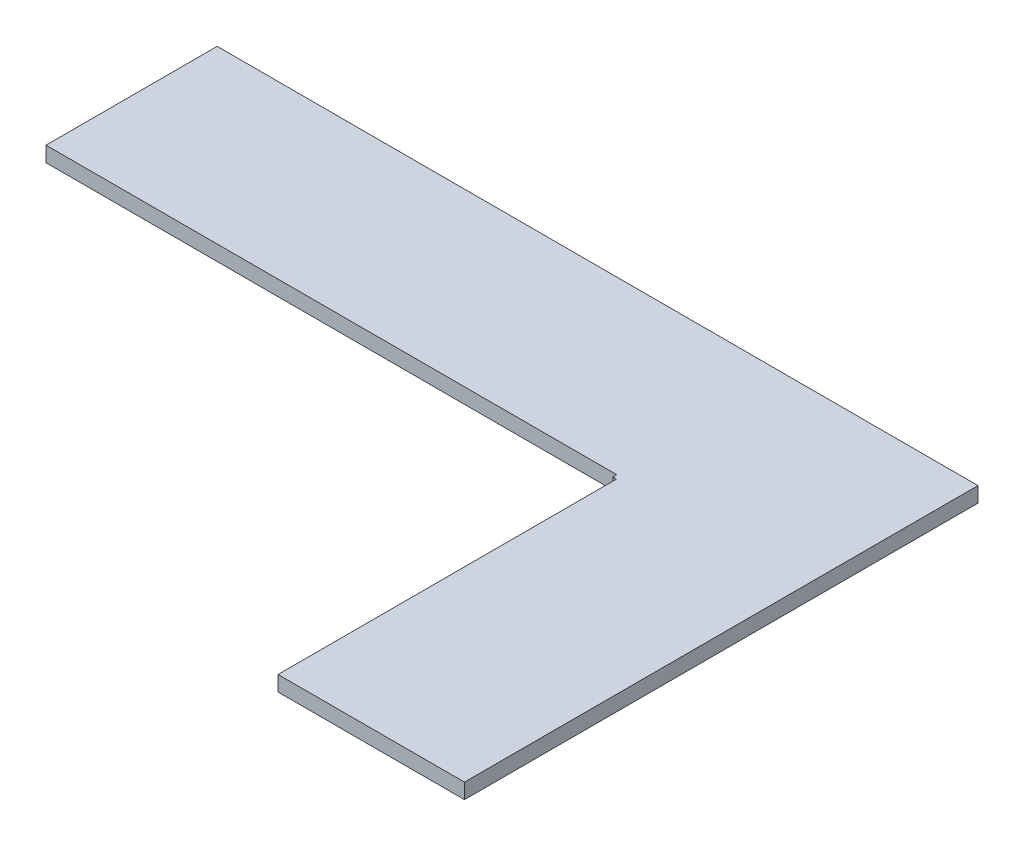
ISO-10303-21;
HEADER;
FILE_DESCRIPTION(('STEP AP214'),'2;1');
FILE_NAME('part.step','',(''),(''),'','','');
FILE_SCHEMA(('AUTOMOTIVE_DESIGN { 1 0 10303 214 1 1 1 1 }'));
ENDSEC;
DATA;
#1=APPLICATION_CONTEXT('core data for automotive mechanical design processes');
#2=APPLICATION_PROTOCOL_DEFINITION('international standard','automotive_design',2000,#1);
#3=PRODUCT_CONTEXT('',#1,'mechanical');
#4=PRODUCT('Part','Part','',(#3));
#5=PRODUCT_RELATED_PRODUCT_CATEGORY('part','',(#4));
#6=PRODUCT_DEFINITION_FORMATION('','',#4);
#7=PRODUCT_DEFINITION_CONTEXT('part definition',#1,'design');
#8=PRODUCT_DEFINITION('design','',#6,#7);
#9=PRODUCT_DEFINITION_SHAPE('','',#8);
#10=(LENGTH_UNIT() NAMED_UNIT(*) SI_UNIT(.MILLI.,.METRE.));
#11=(NAMED_UNIT(*) PLANE_ANGLE_UNIT() SI_UNIT($,.RADIAN.));
#12=(NAMED_UNIT(*) SI_UNIT($,.STERADIAN.) SOLID_ANGLE_UNIT());
#13=UNCERTAINTY_MEASURE_WITH_UNIT(LENGTH_MEASURE(1.E-05),#10,'distance_accuracy_value','');
#14=(GEOMETRIC_REPRESENTATION_CONTEXT(3) GLOBAL_UNCERTAINTY_ASSIGNED_CONTEXT((#13)) GLOBAL_UNIT_ASSIGNED_CONTEXT((#10,
#11,#12)) REPRESENTATION_CONTEXT('',''));
#15=CARTESIAN_POINT('',(0.,0.,0.));
#16=DIRECTION('',(0.,0.,1.));
#17=DIRECTION('',(1.,0.,0.));
#18=AXIS2_PLACEMENT_3D('',#15,#16,#17);
#19=CARTESIAN_POINT('',(0.,4.,-585.));
#20=DIRECTION('',(0.,0.,1.));
#21=DIRECTION('',(1.,0.,0.));
#22=AXIS2_PLACEMENT_3D('',#19,#20,#21);
#23=PLANE('',#22);
#24=DIRECTION('',(0.,1.,0.));
#25=VECTOR('',#24,1.);
#26=CARTESIAN_POINT('',(201.,8.,-585.));
#27=LINE('',#26,#25);
#28=CARTESIAN_POINT('',(201.,4.,-585.));
#29=VERTEX_POINT('',#28);
#30=CARTESIAN_POINT('',(201.,8.,-585.));
#31=VERTEX_POINT('',#30);
#32=EDGE_CURVE('E116',#29,#31,#27,.T.);
#33=ORIENTED_EDGE('',*,*,#32,.F.);
#34=DIRECTION('',(1.,0.,0.));
#35=VECTOR('',#34,1.);
#36=CARTESIAN_POINT('',(0.,4.,-585.));
#37=LINE('',#36,#35);
#38=CARTESIAN_POINT('',(250.,4.,-585.));
#39=VERTEX_POINT('',#38);
#40=EDGE_CURVE('E163',#29,#39,#37,.T.);
#41=ORIENTED_EDGE('',*,*,#40,.T.);
#42=DIRECTION('',(0.,1.,0.));
#43=VECTOR('',#42,1.);
#44=CARTESIAN_POINT('',(250.,4.,-585.));
#45=LINE('',#44,#43);
#46=CARTESIAN_POINT('',(250.,8.,-585.));
#47=VERTEX_POINT('',#46);
#48=EDGE_CURVE('E11',#39,#47,#45,.T.);
#49=ORIENTED_EDGE('',*,*,#48,.T.);
#50=DIRECTION('',(1.,0.,0.));
#51=VECTOR('',#50,1.);
#52=CARTESIAN_POINT('',(0.,8.,-585.));
#53=LINE('',#52,#51);
#54=EDGE_CURVE('E128',#31,#47,#53,.T.);
#55=ORIENTED_EDGE('',*,*,#54,.F.);
#56=EDGE_LOOP('',(#33,#41,#49,#55));
#57=FACE_BOUND('',#56,.T.);
#58=ADVANCED_FACE('F38',(#57),#23,.T.);
#59=CARTESIAN_POINT('',(250.,4.,0.));
#60=DIRECTION('',(-1.,0.,0.));
#61=DIRECTION('',(0.,0.,1.));
#62=AXIS2_PLACEMENT_3D('',#59,#60,#61);
#63=PLANE('',#62);
#64=ORIENTED_EDGE('',*,*,#48,.F.);
#65=DIRECTION('',(0.,0.,1.));
#66=VECTOR('',#65,1.);
#67=CARTESIAN_POINT('',(250.,4.,0.));
#68=LINE('',#67,#66);
#69=CARTESIAN_POINT('',(250.,4.,-720.));
#70=VERTEX_POINT('',#69);
#71=EDGE_CURVE('E159',#39,#70,#68,.F.);
#72=ORIENTED_EDGE('',*,*,#71,.T.);
#73=DIRECTION('',(0.,1.,0.));
#74=VECTOR('',#73,1.);
#75=CARTESIAN_POINT('',(250.,4.,-720.));
#76=LINE('',#75,#74);
#77=CARTESIAN_POINT('',(250.,8.,-720.));
#78=VERTEX_POINT('',#77);
#79=EDGE_CURVE('E48',#70,#78,#76,.T.);
#80=ORIENTED_EDGE('',*,*,#79,.T.);
#81=DIRECTION('',(0.,0.,1.));
#82=VECTOR('',#81,1.);
#83=CARTESIAN_POINT('',(250.,8.,0.));
#84=LINE('',#83,#82);
#85=EDGE_CURVE('E135',#47,#78,#84,.F.);
#86=ORIENTED_EDGE('',*,*,#85,.F.);
#87=EDGE_LOOP('',(#64,#72,#80,#86));
#88=FACE_BOUND('',#87,.T.);
#89=ADVANCED_FACE('F175',(#88),#63,.F.);
#90=CARTESIAN_POINT('',(0.,4.,-720.));
#91=DIRECTION('',(0.,0.,1.));
#92=DIRECTION('',(1.,0.,0.));
#93=AXIS2_PLACEMENT_3D('',#90,#91,#92);
#94=PLANE('',#93);
#95=ORIENTED_EDGE('',*,*,#79,.F.);
#96=DIRECTION('',(1.,0.,0.));
#97=VECTOR('',#96,1.);
#98=CARTESIAN_POINT('',(0.,4.,-720.));
#99=LINE('',#98,#97);
#100=CARTESIAN_POINT('',(50.0000000000001,4.,-720.));
#101=VERTEX_POINT('',#100);
#102=EDGE_CURVE('E155',#70,#101,#99,.F.);
#103=ORIENTED_EDGE('',*,*,#102,.T.);
#104=DIRECTION('',(0.,1.,0.));
#105=VECTOR('',#104,1.);
#106=CARTESIAN_POINT('',(50.0000000000001,4.,-720.));
#107=LINE('',#106,#105);
#108=CARTESIAN_POINT('',(50.0000000000001,8.,-720.));
#109=VERTEX_POINT('',#108);
#110=EDGE_CURVE('E170',#101,#109,#107,.T.);
#111=ORIENTED_EDGE('',*,*,#110,.T.);
#112=DIRECTION('',(1.,0.,0.));
#113=VECTOR('',#112,1.);
#114=CARTESIAN_POINT('',(0.,8.,-720.));
#115=LINE('',#114,#113);
#116=EDGE_CURVE('E140',#78,#109,#115,.F.);
#117=ORIENTED_EDGE('',*,*,#116,.F.);
#118=EDGE_LOOP('',(#95,#103,#111,#117));
#119=FACE_BOUND('',#118,.T.);
#120=ADVANCED_FACE('F182',(#119),#94,.F.);
#121=CARTESIAN_POINT('',(50.0000000000001,4.,0.));
#122=DIRECTION('',(-1.,0.,0.));
#123=DIRECTION('',(0.,0.,1.));
#124=AXIS2_PLACEMENT_3D('',#121,#122,#123);
#125=PLANE('',#124);
#126=ORIENTED_EDGE('',*,*,#110,.F.);
#127=DIRECTION('',(0.,0.,1.));
#128=VECTOR('',#127,1.);
#129=CARTESIAN_POINT('',(50.0000000000001,4.,0.));
#130=LINE('',#129,#128);
#131=CARTESIAN_POINT('',(50.0000000000001,4.,-675.));
#132=VERTEX_POINT('',#131);
#133=EDGE_CURVE('E152',#101,#132,#130,.T.);
#134=ORIENTED_EDGE('',*,*,#133,.T.);
#135=DIRECTION('',(0.,1.,0.));
#136=VECTOR('',#135,1.);
#137=CARTESIAN_POINT('',(50.0000000000001,4.,-675.));
#138=LINE('',#137,#136);
#139=CARTESIAN_POINT('',(50.0000000000001,8.,-675.));
#140=VERTEX_POINT('',#139);
#141=EDGE_CURVE('E64',#132,#140,#138,.T.);
#142=ORIENTED_EDGE('',*,*,#141,.T.);
#143=DIRECTION('',(0.,0.,1.));
#144=VECTOR('',#143,1.);
#145=CARTESIAN_POINT('',(50.0000000000001,8.,0.));
#146=LINE('',#145,#144);
#147=EDGE_CURVE('E184',#109,#140,#146,.T.);
#148=ORIENTED_EDGE('',*,*,#147,.F.);
#149=EDGE_LOOP('',(#126,#134,#142,#148));
#150=FACE_BOUND('',#149,.T.);
#151=ADVANCED_FACE('F207',(#150),#125,.T.);
#152=CARTESIAN_POINT('',(0.,4.,-675.));
#153=DIRECTION('',(0.,0.,1.));
#154=DIRECTION('',(1.,0.,0.));
#155=AXIS2_PLACEMENT_3D('',#152,#153,#154);
#156=PLANE('',#155);
#157=ORIENTED_EDGE('',*,*,#141,.F.);
#158=DIRECTION('',(1.,0.,0.));
#159=VECTOR('',#158,1.);
#160=CARTESIAN_POINT('',(0.,4.,-675.));
#161=LINE('',#160,#159);
#162=CARTESIAN_POINT('',(200.,4.,-675.));
#163=VERTEX_POINT('',#162);
#164=EDGE_CURVE('E146',#132,#163,#161,.T.);
#165=ORIENTED_EDGE('',*,*,#164,.T.);
#166=DIRECTION('',(0.,1.,0.));
#167=VECTOR('',#166,1.);
#168=CARTESIAN_POINT('',(200.,4.,-675.));
#169=LINE('',#168,#167);
#170=CARTESIAN_POINT('',(200.,8.,-675.));
#171=VERTEX_POINT('',#170);
#172=EDGE_CURVE('E42',#163,#171,#169,.T.);
#173=ORIENTED_EDGE('',*,*,#172,.T.);
#174=DIRECTION('',(1.,0.,0.));
#175=VECTOR('',#174,1.);
#176=CARTESIAN_POINT('',(0.,8.,-675.));
#177=LINE('',#176,#175);
#178=EDGE_CURVE('E142',#140,#171,#177,.T.);
#179=ORIENTED_EDGE('',*,*,#178,.F.);
#180=EDGE_LOOP('',(#157,#165,#173,#179));
#181=FACE_BOUND('',#180,.T.);
#182=ADVANCED_FACE('F204',(#181),#156,.T.);
#183=CARTESIAN_POINT('',(200.,4.,0.));
#184=DIRECTION('',(-1.,0.,0.));
#185=DIRECTION('',(0.,0.,1.));
#186=AXIS2_PLACEMENT_3D('',#183,#184,#185);
#187=PLANE('',#186);
#188=DIRECTION('',(0.,-1.,0.));
#189=VECTOR('',#188,1.);
#190=CARTESIAN_POINT('',(200.,7.99999999999999,-674.));
#191=LINE('',#190,#189);
#192=CARTESIAN_POINT('',(200.,7.99999999999999,-674.));
#193=VERTEX_POINT('',#192);
#194=CARTESIAN_POINT('',(200.,4.,-674.));
#195=VERTEX_POINT('',#194);
#196=EDGE_CURVE('E114',#193,#195,#191,.T.);
#197=ORIENTED_EDGE('',*,*,#196,.F.);
#198=DIRECTION('',(0.,0.,1.));
#199=VECTOR('',#198,1.);
#200=CARTESIAN_POINT('',(200.,8.,0.));
#201=LINE('',#200,#199);
#202=EDGE_CURVE('E136',#171,#193,#201,.T.);
#203=ORIENTED_EDGE('',*,*,#202,.F.);
#204=ORIENTED_EDGE('',*,*,#172,.F.);
#205=DIRECTION('',(0.,0.,1.));
#206=VECTOR('',#205,1.);
#207=CARTESIAN_POINT('',(200.,4.,0.));
#208=LINE('',#207,#206);
#209=EDGE_CURVE('E150',#163,#195,#208,.T.);
#210=ORIENTED_EDGE('',*,*,#209,.T.);
#211=EDGE_LOOP('',(#197,#203,#204,#210));
#212=FACE_BOUND('',#211,.T.);
#213=ADVANCED_FACE('F40',(#212),#187,.T.);
#214=CARTESIAN_POINT('',(0.,8.,0.));
#215=DIRECTION('',(0.,1.,0.));
#216=DIRECTION('',(0.,0.,1.));
#217=AXIS2_PLACEMENT_3D('',#214,#215,#216);
#218=PLANE('',#217);
#219=DIRECTION('',(-1.,0.,0.));
#220=VECTOR('',#219,1.);
#221=CARTESIAN_POINT('',(201.,7.99999999999999,-674.));
#222=LINE('',#221,#220);
#223=CARTESIAN_POINT('',(201.,7.99999999999999,-674.));
#224=VERTEX_POINT('',#223);
#225=EDGE_CURVE('E112',#224,#193,#222,.T.);
#226=ORIENTED_EDGE('',*,*,#225,.F.);
#227=DIRECTION('',(0.,0.,-1.));
#228=VECTOR('',#227,1.);
#229=CARTESIAN_POINT('',(201.,8.,-585.));
#230=LINE('',#229,#228);
#231=EDGE_CURVE('E119',#31,#224,#230,.T.);
#232=ORIENTED_EDGE('',*,*,#231,.F.);
#233=ORIENTED_EDGE('',*,*,#54,.T.);
#234=ORIENTED_EDGE('',*,*,#85,.T.);
#235=ORIENTED_EDGE('',*,*,#116,.T.);
#236=ORIENTED_EDGE('',*,*,#147,.T.);
#237=ORIENTED_EDGE('',*,*,#178,.T.);
#238=ORIENTED_EDGE('',*,*,#202,.T.);
#239=EDGE_LOOP('',(#226,#232,#233,#234,#235,#236,#237,#238));
#240=FACE_BOUND('',#239,.T.);
#241=ADVANCED_FACE('F126',(#240),#218,.T.);
#242=CARTESIAN_POINT('',(0.,4.,0.));
#243=DIRECTION('',(0.,1.,0.));
#244=DIRECTION('',(0.,0.,1.));
#245=AXIS2_PLACEMENT_3D('',#242,#243,#244);
#246=PLANE('',#245);
#247=DIRECTION('',(0.,0.,1.));
#248=VECTOR('',#247,1.);
#249=CARTESIAN_POINT('',(201.,4.,-585.));
#250=LINE('',#249,#248);
#251=CARTESIAN_POINT('',(201.,4.,-674.));
#252=VERTEX_POINT('',#251);
#253=EDGE_CURVE('E102',#252,#29,#250,.T.);
#254=ORIENTED_EDGE('',*,*,#253,.F.);
#255=DIRECTION('',(-1.,0.,0.));
#256=VECTOR('',#255,1.);
#257=CARTESIAN_POINT('',(201.,4.,-674.));
#258=LINE('',#257,#256);
#259=EDGE_CURVE('E151',#252,#195,#258,.T.);
#260=ORIENTED_EDGE('',*,*,#259,.T.);
#261=ORIENTED_EDGE('',*,*,#209,.F.);
#262=ORIENTED_EDGE('',*,*,#164,.F.);
#263=ORIENTED_EDGE('',*,*,#133,.F.);
#264=ORIENTED_EDGE('',*,*,#102,.F.);
#265=ORIENTED_EDGE('',*,*,#71,.F.);
#266=ORIENTED_EDGE('',*,*,#40,.F.);
#267=EDGE_LOOP('',(#254,#260,#261,#262,#263,#264,#265,#266));
#268=FACE_BOUND('',#267,.T.);
#269=ADVANCED_FACE('F201',(#268),#246,.F.);
#270=CARTESIAN_POINT('',(201.,7.99999999999999,-674.));
#271=DIRECTION('',(0.,0.,-1.));
#272=DIRECTION('',(-1.,0.,0.));
#273=AXIS2_PLACEMENT_3D('',#270,#271,#272);
#274=PLANE('',#273);
#275=ORIENTED_EDGE('',*,*,#196,.T.);
#276=ORIENTED_EDGE('',*,*,#259,.F.);
#277=DIRECTION('',(0.,-1.,0.));
#278=VECTOR('',#277,1.);
#279=CARTESIAN_POINT('',(201.,7.99999999999999,-674.));
#280=LINE('',#279,#278);
#281=EDGE_CURVE('E55',#224,#252,#280,.T.);
#282=ORIENTED_EDGE('',*,*,#281,.F.);
#283=ORIENTED_EDGE('',*,*,#225,.T.);
#284=EDGE_LOOP('',(#275,#276,#282,#283));
#285=FACE_BOUND('',#284,.T.);
#286=ADVANCED_FACE('F263',(#285),#274,.F.);
#287=CARTESIAN_POINT('',(201.,0.,0.));
#288=DIRECTION('',(1.,0.,0.));
#289=DIRECTION('',(0.,0.,-1.));
#290=AXIS2_PLACEMENT_3D('',#287,#288,#289);
#291=PLANE('',#290);
#292=ORIENTED_EDGE('',*,*,#32,.T.);
#293=ORIENTED_EDGE('',*,*,#231,.T.);
#294=ORIENTED_EDGE('',*,*,#281,.T.);
#295=ORIENTED_EDGE('',*,*,#253,.T.);
#296=EDGE_LOOP('',(#292,#293,#294,#295));
#297=FACE_BOUND('',#296,.T.);
#298=ADVANCED_FACE('F118',(#297),#291,.F.);
#299=CLOSED_SHELL('',(#58,#89,#120,#151,#182,#213,#241,#269,#286,#298));
#300=MANIFOLD_SOLID_BREP('B2',#299);
#301=ADVANCED_BREP_SHAPE_REPRESENTATION('',(#18,#300),#14);
#302=SHAPE_DEFINITION_REPRESENTATION(#9,#301);
ENDSEC;
END-ISO-10303-21;
